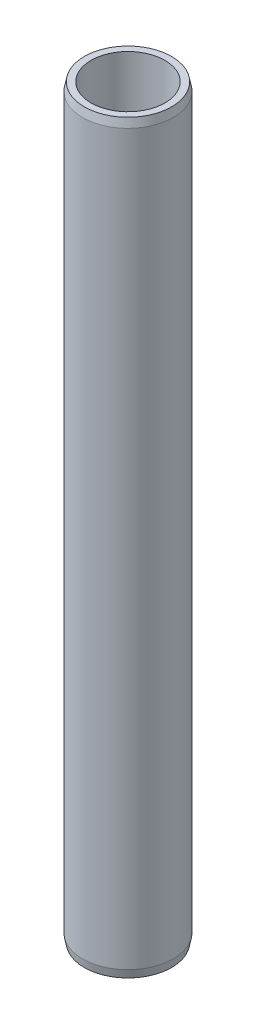
ISO-10303-21;
HEADER;
FILE_DESCRIPTION(('STEP AP214'),'2;1');
FILE_NAME('part.step','',(''),(''),'','','');
FILE_SCHEMA(('AUTOMOTIVE_DESIGN { 1 0 10303 214 1 1 1 1 }'));
ENDSEC;
DATA;
#1=APPLICATION_CONTEXT('core data for automotive mechanical design processes');
#2=APPLICATION_PROTOCOL_DEFINITION('international standard','automotive_design',2000,#1);
#3=PRODUCT_CONTEXT('',#1,'mechanical');
#4=PRODUCT('Part','Part','',(#3));
#5=PRODUCT_RELATED_PRODUCT_CATEGORY('part','',(#4));
#6=PRODUCT_DEFINITION_FORMATION('','',#4);
#7=PRODUCT_DEFINITION_CONTEXT('part definition',#1,'design');
#8=PRODUCT_DEFINITION('design','',#6,#7);
#9=PRODUCT_DEFINITION_SHAPE('','',#8);
#10=(LENGTH_UNIT() NAMED_UNIT(*) SI_UNIT(.MILLI.,.METRE.));
#11=(NAMED_UNIT(*) PLANE_ANGLE_UNIT() SI_UNIT($,.RADIAN.));
#12=(NAMED_UNIT(*) SI_UNIT($,.STERADIAN.) SOLID_ANGLE_UNIT());
#13=UNCERTAINTY_MEASURE_WITH_UNIT(LENGTH_MEASURE(1.E-05),#10,'distance_accuracy_value','');
#14=(GEOMETRIC_REPRESENTATION_CONTEXT(3) GLOBAL_UNCERTAINTY_ASSIGNED_CONTEXT((#13)) GLOBAL_UNIT_ASSIGNED_CONTEXT((#10,
#11,#12)) REPRESENTATION_CONTEXT('',''));
#15=CARTESIAN_POINT('',(0.,0.,0.));
#16=DIRECTION('',(0.,0.,1.));
#17=DIRECTION('',(1.,0.,0.));
#18=AXIS2_PLACEMENT_3D('',#15,#16,#17);
#19=CARTESIAN_POINT('',(0.,111.,0.));
#20=DIRECTION('',(0.,1.,0.));
#21=DIRECTION('',(0.,0.,1.));
#22=AXIS2_PLACEMENT_3D('',#19,#20,#21);
#23=PLANE('',#22);
#24=CARTESIAN_POINT('',(0.,111.,0.));
#25=DIRECTION('',(0.,1.,0.));
#26=DIRECTION('',(0.,0.,1.));
#27=AXIS2_PLACEMENT_3D('',#24,#25,#26);
#28=CIRCLE('',#27,13.);
#29=CARTESIAN_POINT('',(0.,111.,13.));
#30=VERTEX_POINT('',#29);
#31=EDGE_CURVE('E31',#30,#30,#28,.T.);
#32=ORIENTED_EDGE('',*,*,#31,.T.);
#33=EDGE_LOOP('',(#32));
#34=FACE_BOUND('',#33,.T.);
#35=CARTESIAN_POINT('',(0.,111.,0.));
#36=DIRECTION('',(0.,1.,0.));
#37=DIRECTION('',(0.,0.,1.));
#38=AXIS2_PLACEMENT_3D('',#35,#36,#37);
#39=CIRCLE('',#38,11.);
#40=CARTESIAN_POINT('',(0.,111.,11.));
#41=VERTEX_POINT('',#40);
#42=EDGE_CURVE('E44',#41,#41,#39,.T.);
#43=ORIENTED_EDGE('',*,*,#42,.F.);
#44=EDGE_LOOP('',(#43));
#45=FACE_BOUND('',#44,.T.);
#46=ADVANCED_FACE('F24',(#34,#45),#23,.T.);
#47=CARTESIAN_POINT('',(0.,-111.,0.));
#48=DIRECTION('',(0.,1.,0.));
#49=DIRECTION('',(0.,0.,1.));
#50=AXIS2_PLACEMENT_3D('',#47,#48,#49);
#51=PLANE('',#50);
#52=CARTESIAN_POINT('',(0.,-111.,0.));
#53=DIRECTION('',(0.,1.,0.));
#54=DIRECTION('',(0.,0.,1.));
#55=AXIS2_PLACEMENT_3D('',#52,#53,#54);
#56=CIRCLE('',#55,13.0000000000001);
#57=CARTESIAN_POINT('',(0.,-111.,13.0000000000001));
#58=VERTEX_POINT('',#57);
#59=EDGE_CURVE('E35',#58,#58,#56,.F.);
#60=ORIENTED_EDGE('',*,*,#59,.T.);
#61=EDGE_LOOP('',(#60));
#62=FACE_BOUND('',#61,.T.);
#63=CARTESIAN_POINT('',(0.,-111.,0.));
#64=DIRECTION('',(0.,1.,0.));
#65=DIRECTION('',(0.,0.,1.));
#66=AXIS2_PLACEMENT_3D('',#63,#64,#65);
#67=CIRCLE('',#66,11.);
#68=CARTESIAN_POINT('',(0.,-111.,11.));
#69=VERTEX_POINT('',#68);
#70=EDGE_CURVE('E47',#69,#69,#67,.T.);
#71=ORIENTED_EDGE('',*,*,#70,.T.);
#72=EDGE_LOOP('',(#71));
#73=FACE_BOUND('',#72,.T.);
#74=ADVANCED_FACE('F51',(#62,#73),#51,.F.);
#75=CARTESIAN_POINT('',(0.,111.,0.));
#76=DIRECTION('',(0.,-1.,0.));
#77=DIRECTION('',(0.,0.,-1.));
#78=AXIS2_PLACEMENT_3D('',#75,#76,#77);
#79=CYLINDRICAL_SURFACE('',#78,13.5);
#80=CARTESIAN_POINT('',(0.,108.5,0.));
#81=DIRECTION('',(0.,1.,0.));
#82=DIRECTION('',(0.,0.,1.));
#83=AXIS2_PLACEMENT_3D('',#80,#81,#82);
#84=CIRCLE('',#83,13.5);
#85=CARTESIAN_POINT('',(0.,108.5,13.5));
#86=VERTEX_POINT('',#85);
#87=EDGE_CURVE('E10',#86,#86,#84,.F.);
#88=ORIENTED_EDGE('',*,*,#87,.T.);
#89=EDGE_LOOP('',(#88));
#90=FACE_BOUND('',#89,.T.);
#91=CARTESIAN_POINT('',(0.,-108.5,0.));
#92=DIRECTION('',(0.,1.,0.));
#93=DIRECTION('',(0.,0.,1.));
#94=AXIS2_PLACEMENT_3D('',#91,#92,#93);
#95=CIRCLE('',#94,13.5);
#96=CARTESIAN_POINT('',(0.,-108.5,13.5));
#97=VERTEX_POINT('',#96);
#98=EDGE_CURVE('E39',#97,#97,#95,.T.);
#99=ORIENTED_EDGE('',*,*,#98,.T.);
#100=EDGE_LOOP('',(#99));
#101=FACE_BOUND('',#100,.T.);
#102=ADVANCED_FACE('F26',(#90,#101),#79,.T.);
#103=CARTESIAN_POINT('',(0.,111.,0.));
#104=DIRECTION('',(0.,-1.,0.));
#105=DIRECTION('',(0.,0.,-1.));
#106=AXIS2_PLACEMENT_3D('',#103,#104,#105);
#107=CYLINDRICAL_SURFACE('',#106,11.);
#108=ORIENTED_EDGE('',*,*,#42,.T.);
#109=EDGE_LOOP('',(#108));
#110=FACE_BOUND('',#109,.T.);
#111=ORIENTED_EDGE('',*,*,#70,.F.);
#112=EDGE_LOOP('',(#111));
#113=FACE_BOUND('',#112,.T.);
#114=ADVANCED_FACE('F53',(#110,#113),#107,.F.);
#115=CARTESIAN_POINT('',(0.,-108.5,0.));
#116=DIRECTION('',(0.,1.,0.));
#117=DIRECTION('',(0.,0.,1.));
#118=AXIS2_PLACEMENT_3D('',#115,#116,#117);
#119=CONICAL_SURFACE('',#118,13.5,0.197395559849876);
#120=ORIENTED_EDGE('',*,*,#59,.F.);
#121=EDGE_LOOP('',(#120));
#122=FACE_BOUND('',#121,.T.);
#123=ORIENTED_EDGE('',*,*,#98,.F.);
#124=EDGE_LOOP('',(#123));
#125=FACE_BOUND('',#124,.T.);
#126=ADVANCED_FACE('F55',(#122,#125),#119,.T.);
#127=CARTESIAN_POINT('',(0.,111.,0.));
#128=DIRECTION('',(0.,-1.,0.));
#129=DIRECTION('',(0.,0.,-1.));
#130=AXIS2_PLACEMENT_3D('',#127,#128,#129);
#131=CONICAL_SURFACE('',#130,13.,0.197395559849876);
#132=ORIENTED_EDGE('',*,*,#87,.F.);
#133=EDGE_LOOP('',(#132));
#134=FACE_BOUND('',#133,.T.);
#135=ORIENTED_EDGE('',*,*,#31,.F.);
#136=EDGE_LOOP('',(#135));
#137=FACE_BOUND('',#136,.T.);
#138=ADVANCED_FACE('F62',(#134,#137),#131,.T.);
#139=CLOSED_SHELL('',(#46,#74,#102,#114,#126,#138));
#140=MANIFOLD_SOLID_BREP('B2',#139);
#141=ADVANCED_BREP_SHAPE_REPRESENTATION('',(#18,#140),#14);
#142=SHAPE_DEFINITION_REPRESENTATION(#9,#141);
ENDSEC;
END-ISO-10303-21;
